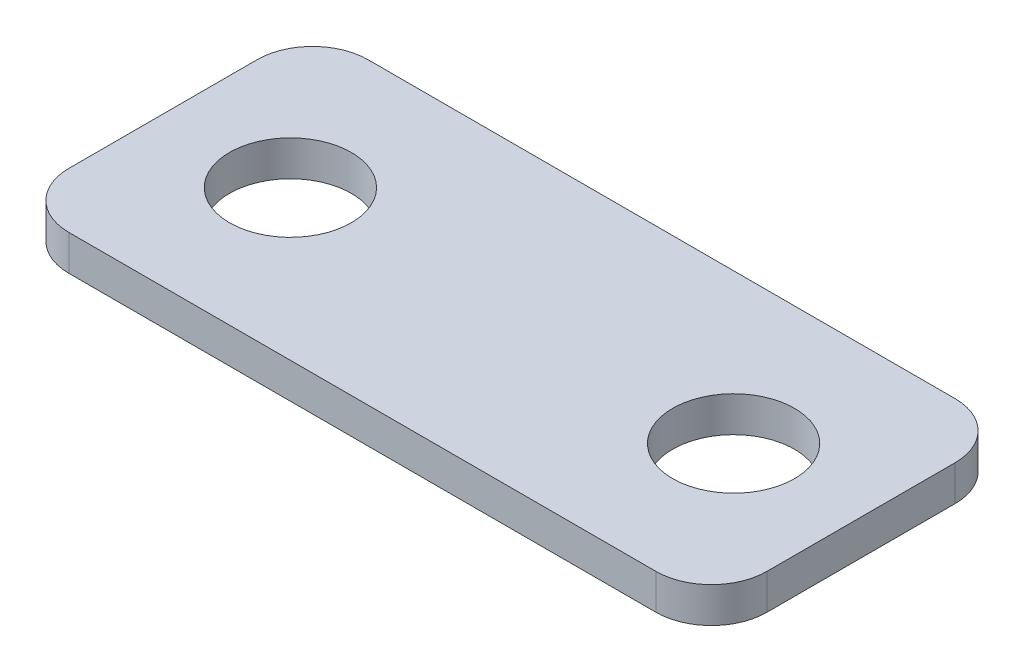
ISO-10303-21;
HEADER;
FILE_DESCRIPTION(('STEP AP214'),'2;1');
FILE_NAME('part.step','',(''),(''),'','','');
FILE_SCHEMA(('AUTOMOTIVE_DESIGN { 1 0 10303 214 1 1 1 1 }'));
ENDSEC;
DATA;
#1=APPLICATION_CONTEXT('core data for automotive mechanical design processes');
#2=APPLICATION_PROTOCOL_DEFINITION('international standard','automotive_design',2000,#1);
#3=PRODUCT_CONTEXT('',#1,'mechanical');
#4=PRODUCT('Part','Part','',(#3));
#5=PRODUCT_RELATED_PRODUCT_CATEGORY('part','',(#4));
#6=PRODUCT_DEFINITION_FORMATION('','',#4);
#7=PRODUCT_DEFINITION_CONTEXT('part definition',#1,'design');
#8=PRODUCT_DEFINITION('design','',#6,#7);
#9=PRODUCT_DEFINITION_SHAPE('','',#8);
#10=(LENGTH_UNIT() NAMED_UNIT(*) SI_UNIT(.MILLI.,.METRE.));
#11=(NAMED_UNIT(*) PLANE_ANGLE_UNIT() SI_UNIT($,.RADIAN.));
#12=(NAMED_UNIT(*) SI_UNIT($,.STERADIAN.) SOLID_ANGLE_UNIT());
#13=UNCERTAINTY_MEASURE_WITH_UNIT(LENGTH_MEASURE(1.E-05),#10,'distance_accuracy_value','');
#14=(GEOMETRIC_REPRESENTATION_CONTEXT(3) GLOBAL_UNCERTAINTY_ASSIGNED_CONTEXT((#13)) GLOBAL_UNIT_ASSIGNED_CONTEXT((#10,
#11,#12)) REPRESENTATION_CONTEXT('',''));
#15=CARTESIAN_POINT('',(0.,0.,0.));
#16=DIRECTION('',(0.,0.,1.));
#17=DIRECTION('',(1.,0.,0.));
#18=AXIS2_PLACEMENT_3D('',#15,#16,#17);
#19=CARTESIAN_POINT('',(26.5,-3.2,8.5));
#20=DIRECTION('',(0.,1.,0.));
#21=DIRECTION('',(0.,0.,1.));
#22=AXIS2_PLACEMENT_3D('',#19,#20,#21);
#23=CYLINDRICAL_SURFACE('',#22,5.);
#24=CARTESIAN_POINT('',(26.5,0.,8.5));
#25=DIRECTION('',(0.,1.,0.));
#26=DIRECTION('',(0.,0.,1.));
#27=AXIS2_PLACEMENT_3D('',#24,#25,#26);
#28=CIRCLE('',#27,5.);
#29=CARTESIAN_POINT('',(26.5,0.,13.5));
#30=VERTEX_POINT('',#29);
#31=CARTESIAN_POINT('',(31.5,0.,8.5));
#32=VERTEX_POINT('',#31);
#33=EDGE_CURVE('E138',#30,#32,#28,.T.);
#34=ORIENTED_EDGE('',*,*,#33,.F.);
#35=DIRECTION('',(0.,1.,0.));
#36=VECTOR('',#35,1.);
#37=CARTESIAN_POINT('',(26.5,-3.2,13.5));
#38=LINE('',#37,#36);
#39=CARTESIAN_POINT('',(26.5,-3.2,13.5));
#40=VERTEX_POINT('',#39);
#41=EDGE_CURVE('E11',#40,#30,#38,.T.);
#42=ORIENTED_EDGE('',*,*,#41,.F.);
#43=CARTESIAN_POINT('',(26.5,-3.2,8.5));
#44=DIRECTION('',(0.,1.,0.));
#45=DIRECTION('',(0.,0.,1.));
#46=AXIS2_PLACEMENT_3D('',#43,#44,#45);
#47=CIRCLE('',#46,5.);
#48=CARTESIAN_POINT('',(31.5,-3.2,8.5));
#49=VERTEX_POINT('',#48);
#50=EDGE_CURVE('E159',#40,#49,#47,.T.);
#51=ORIENTED_EDGE('',*,*,#50,.T.);
#52=DIRECTION('',(0.,1.,0.));
#53=VECTOR('',#52,1.);
#54=CARTESIAN_POINT('',(31.5,-3.2,8.5));
#55=LINE('',#54,#53);
#56=EDGE_CURVE('E44',#49,#32,#55,.T.);
#57=ORIENTED_EDGE('',*,*,#56,.T.);
#58=EDGE_LOOP('',(#34,#42,#51,#57));
#59=FACE_BOUND('',#58,.T.);
#60=ADVANCED_FACE('F41',(#59),#23,.T.);
#61=CARTESIAN_POINT('',(26.5,-3.2,13.5));
#62=DIRECTION('',(0.,0.,1.));
#63=DIRECTION('',(1.,0.,0.));
#64=AXIS2_PLACEMENT_3D('',#61,#62,#63);
#65=PLANE('',#64);
#66=DIRECTION('',(1.,0.,0.));
#67=VECTOR('',#66,1.);
#68=CARTESIAN_POINT('',(26.5,0.,13.5));
#69=LINE('',#68,#67);
#70=CARTESIAN_POINT('',(-26.5,0.,13.5));
#71=VERTEX_POINT('',#70);
#72=EDGE_CURVE('E157',#71,#30,#69,.T.);
#73=ORIENTED_EDGE('',*,*,#72,.F.);
#74=DIRECTION('',(0.,1.,0.));
#75=VECTOR('',#74,1.);
#76=CARTESIAN_POINT('',(-26.5,-3.2,13.5));
#77=LINE('',#76,#75);
#78=CARTESIAN_POINT('',(-26.5,-3.2,13.5));
#79=VERTEX_POINT('',#78);
#80=EDGE_CURVE('E50',#79,#71,#77,.T.);
#81=ORIENTED_EDGE('',*,*,#80,.F.);
#82=DIRECTION('',(1.,0.,0.));
#83=VECTOR('',#82,1.);
#84=CARTESIAN_POINT('',(26.5,-3.2,13.5));
#85=LINE('',#84,#83);
#86=EDGE_CURVE('E128',#79,#40,#85,.T.);
#87=ORIENTED_EDGE('',*,*,#86,.T.);
#88=ORIENTED_EDGE('',*,*,#41,.T.);
#89=EDGE_LOOP('',(#73,#81,#87,#88));
#90=FACE_BOUND('',#89,.T.);
#91=ADVANCED_FACE('F171',(#90),#65,.T.);
#92=CARTESIAN_POINT('',(-26.5,-3.2,8.5));
#93=DIRECTION('',(0.,1.,0.));
#94=DIRECTION('',(0.,0.,1.));
#95=AXIS2_PLACEMENT_3D('',#92,#93,#94);
#96=CYLINDRICAL_SURFACE('',#95,5.);
#97=CARTESIAN_POINT('',(-26.5,0.,8.5));
#98=DIRECTION('',(0.,1.,0.));
#99=DIRECTION('',(0.,0.,-1.));
#100=AXIS2_PLACEMENT_3D('',#97,#98,#99);
#101=CIRCLE('',#100,5.);
#102=CARTESIAN_POINT('',(-31.5,0.,8.5));
#103=VERTEX_POINT('',#102);
#104=EDGE_CURVE('E115',#103,#71,#101,.T.);
#105=ORIENTED_EDGE('',*,*,#104,.F.);
#106=DIRECTION('',(0.,1.,0.));
#107=VECTOR('',#106,1.);
#108=CARTESIAN_POINT('',(-31.5,-3.2,8.5));
#109=LINE('',#108,#107);
#110=CARTESIAN_POINT('',(-31.5,-3.2,8.5));
#111=VERTEX_POINT('',#110);
#112=EDGE_CURVE('E110',#111,#103,#109,.T.);
#113=ORIENTED_EDGE('',*,*,#112,.F.);
#114=CARTESIAN_POINT('',(-26.5,-3.2,8.5));
#115=DIRECTION('',(0.,1.,0.));
#116=DIRECTION('',(0.,0.,-1.));
#117=AXIS2_PLACEMENT_3D('',#114,#115,#116);
#118=CIRCLE('',#117,5.);
#119=EDGE_CURVE('E113',#111,#79,#118,.T.);
#120=ORIENTED_EDGE('',*,*,#119,.T.);
#121=ORIENTED_EDGE('',*,*,#80,.T.);
#122=EDGE_LOOP('',(#105,#113,#120,#121));
#123=FACE_BOUND('',#122,.T.);
#124=ADVANCED_FACE('F112',(#123),#96,.T.);
#125=CARTESIAN_POINT('',(-31.5,-3.2,8.5));
#126=DIRECTION('',(-1.,0.,0.));
#127=DIRECTION('',(0.,0.,1.));
#128=AXIS2_PLACEMENT_3D('',#125,#126,#127);
#129=PLANE('',#128);
#130=DIRECTION('',(0.,0.,1.));
#131=VECTOR('',#130,1.);
#132=CARTESIAN_POINT('',(-31.5,0.,8.5));
#133=LINE('',#132,#131);
#134=CARTESIAN_POINT('',(-31.5,0.,-8.5));
#135=VERTEX_POINT('',#134);
#136=EDGE_CURVE('E154',#135,#103,#133,.T.);
#137=ORIENTED_EDGE('',*,*,#136,.F.);
#138=DIRECTION('',(0.,1.,0.));
#139=VECTOR('',#138,1.);
#140=CARTESIAN_POINT('',(-31.5,-3.2,-8.5));
#141=LINE('',#140,#139);
#142=CARTESIAN_POINT('',(-31.5,-3.2,-8.5));
#143=VERTEX_POINT('',#142);
#144=EDGE_CURVE('E120',#143,#135,#141,.T.);
#145=ORIENTED_EDGE('',*,*,#144,.F.);
#146=DIRECTION('',(0.,0.,1.));
#147=VECTOR('',#146,1.);
#148=CARTESIAN_POINT('',(-31.5,-3.2,8.5));
#149=LINE('',#148,#147);
#150=EDGE_CURVE('E126',#143,#111,#149,.T.);
#151=ORIENTED_EDGE('',*,*,#150,.T.);
#152=ORIENTED_EDGE('',*,*,#112,.T.);
#153=EDGE_LOOP('',(#137,#145,#151,#152));
#154=FACE_BOUND('',#153,.T.);
#155=ADVANCED_FACE('F130',(#154),#129,.T.);
#156=CARTESIAN_POINT('',(-26.5,-3.2,-8.5));
#157=DIRECTION('',(0.,1.,0.));
#158=DIRECTION('',(0.,0.,1.));
#159=AXIS2_PLACEMENT_3D('',#156,#157,#158);
#160=CYLINDRICAL_SURFACE('',#159,5.);
#161=CARTESIAN_POINT('',(-26.5,0.,-8.5));
#162=DIRECTION('',(0.,1.,0.));
#163=DIRECTION('',(0.,0.,1.));
#164=AXIS2_PLACEMENT_3D('',#161,#162,#163);
#165=CIRCLE('',#164,5.);
#166=CARTESIAN_POINT('',(-26.5,0.,-13.5));
#167=VERTEX_POINT('',#166);
#168=EDGE_CURVE('E151',#167,#135,#165,.T.);
#169=ORIENTED_EDGE('',*,*,#168,.F.);
#170=DIRECTION('',(0.,1.,0.));
#171=VECTOR('',#170,1.);
#172=CARTESIAN_POINT('',(-26.5,-3.2,-13.5));
#173=LINE('',#172,#171);
#174=CARTESIAN_POINT('',(-26.5,-3.2,-13.5));
#175=VERTEX_POINT('',#174);
#176=EDGE_CURVE('E163',#175,#167,#173,.T.);
#177=ORIENTED_EDGE('',*,*,#176,.F.);
#178=CARTESIAN_POINT('',(-26.5,-3.2,-8.5));
#179=DIRECTION('',(0.,1.,0.));
#180=DIRECTION('',(0.,0.,1.));
#181=AXIS2_PLACEMENT_3D('',#178,#179,#180);
#182=CIRCLE('',#181,5.);
#183=EDGE_CURVE('E131',#175,#143,#182,.T.);
#184=ORIENTED_EDGE('',*,*,#183,.T.);
#185=ORIENTED_EDGE('',*,*,#144,.T.);
#186=EDGE_LOOP('',(#169,#177,#184,#185));
#187=FACE_BOUND('',#186,.T.);
#188=ADVANCED_FACE('F184',(#187),#160,.T.);
#189=CARTESIAN_POINT('',(26.5,-3.2,-13.5));
#190=DIRECTION('',(0.,0.,-1.));
#191=DIRECTION('',(-1.,0.,0.));
#192=AXIS2_PLACEMENT_3D('',#189,#190,#191);
#193=PLANE('',#192);
#194=DIRECTION('',(-1.,0.,0.));
#195=VECTOR('',#194,1.);
#196=CARTESIAN_POINT('',(26.5,0.,-13.5));
#197=LINE('',#196,#195);
#198=CARTESIAN_POINT('',(26.5,0.,-13.5));
#199=VERTEX_POINT('',#198);
#200=EDGE_CURVE('E148',#199,#167,#197,.T.);
#201=ORIENTED_EDGE('',*,*,#200,.F.);
#202=DIRECTION('',(0.,1.,0.));
#203=VECTOR('',#202,1.);
#204=CARTESIAN_POINT('',(26.5,-3.2,-13.5));
#205=LINE('',#204,#203);
#206=CARTESIAN_POINT('',(26.5,-3.2,-13.5));
#207=VERTEX_POINT('',#206);
#208=EDGE_CURVE('E165',#207,#199,#205,.T.);
#209=ORIENTED_EDGE('',*,*,#208,.F.);
#210=DIRECTION('',(-1.,0.,0.));
#211=VECTOR('',#210,1.);
#212=CARTESIAN_POINT('',(26.5,-3.2,-13.5));
#213=LINE('',#212,#211);
#214=EDGE_CURVE('E133',#207,#175,#213,.T.);
#215=ORIENTED_EDGE('',*,*,#214,.T.);
#216=ORIENTED_EDGE('',*,*,#176,.T.);
#217=EDGE_LOOP('',(#201,#209,#215,#216));
#218=FACE_BOUND('',#217,.T.);
#219=ADVANCED_FACE('F187',(#218),#193,.T.);
#220=CARTESIAN_POINT('',(26.5,-3.2,-8.5));
#221=DIRECTION('',(0.,1.,0.));
#222=DIRECTION('',(0.,0.,1.));
#223=AXIS2_PLACEMENT_3D('',#220,#221,#222);
#224=CYLINDRICAL_SURFACE('',#223,5.);
#225=CARTESIAN_POINT('',(26.5,0.,-8.5));
#226=DIRECTION('',(0.,1.,0.));
#227=DIRECTION('',(0.,0.,1.));
#228=AXIS2_PLACEMENT_3D('',#225,#226,#227);
#229=CIRCLE('',#228,5.);
#230=CARTESIAN_POINT('',(31.5,0.,-8.5));
#231=VERTEX_POINT('',#230);
#232=EDGE_CURVE('E145',#231,#199,#229,.T.);
#233=ORIENTED_EDGE('',*,*,#232,.F.);
#234=DIRECTION('',(0.,1.,0.));
#235=VECTOR('',#234,1.);
#236=CARTESIAN_POINT('',(31.5,-3.2,-8.5));
#237=LINE('',#236,#235);
#238=CARTESIAN_POINT('',(31.5,-3.2,-8.5));
#239=VERTEX_POINT('',#238);
#240=EDGE_CURVE('E166',#239,#231,#237,.T.);
#241=ORIENTED_EDGE('',*,*,#240,.F.);
#242=CARTESIAN_POINT('',(26.5,-3.2,-8.5));
#243=DIRECTION('',(0.,1.,0.));
#244=DIRECTION('',(0.,0.,1.));
#245=AXIS2_PLACEMENT_3D('',#242,#243,#244);
#246=CIRCLE('',#245,5.);
#247=EDGE_CURVE('E233',#239,#207,#246,.T.);
#248=ORIENTED_EDGE('',*,*,#247,.T.);
#249=ORIENTED_EDGE('',*,*,#208,.T.);
#250=EDGE_LOOP('',(#233,#241,#248,#249));
#251=FACE_BOUND('',#250,.T.);
#252=ADVANCED_FACE('F191',(#251),#224,.T.);
#253=CARTESIAN_POINT('',(31.5,-3.2,8.5));
#254=DIRECTION('',(1.,0.,0.));
#255=DIRECTION('',(0.,0.,-1.));
#256=AXIS2_PLACEMENT_3D('',#253,#254,#255);
#257=PLANE('',#256);
#258=DIRECTION('',(0.,0.,-1.));
#259=VECTOR('',#258,1.);
#260=CARTESIAN_POINT('',(31.5,0.,8.5));
#261=LINE('',#260,#259);
#262=EDGE_CURVE('E141',#32,#231,#261,.T.);
#263=ORIENTED_EDGE('',*,*,#262,.F.);
#264=ORIENTED_EDGE('',*,*,#56,.F.);
#265=DIRECTION('',(0.,0.,-1.));
#266=VECTOR('',#265,1.);
#267=CARTESIAN_POINT('',(31.5,-3.2,8.5));
#268=LINE('',#267,#266);
#269=EDGE_CURVE('E231',#49,#239,#268,.T.);
#270=ORIENTED_EDGE('',*,*,#269,.T.);
#271=ORIENTED_EDGE('',*,*,#240,.T.);
#272=EDGE_LOOP('',(#263,#264,#270,#271));
#273=FACE_BOUND('',#272,.T.);
#274=ADVANCED_FACE('F168',(#273),#257,.T.);
#275=CARTESIAN_POINT('',(26.5,-3.2,8.5));
#276=DIRECTION('',(0.,1.,0.));
#277=DIRECTION('',(0.,0.,1.));
#278=AXIS2_PLACEMENT_3D('',#275,#276,#277);
#279=PLANE('',#278);
#280=CARTESIAN_POINT('',(20.,-3.2,0.));
#281=DIRECTION('',(0.,1.,0.));
#282=DIRECTION('',(0.,0.,1.));
#283=AXIS2_PLACEMENT_3D('',#280,#281,#282);
#284=CIRCLE('',#283,5.5);
#285=CARTESIAN_POINT('',(20.,-3.2,5.49999999999999));
#286=VERTEX_POINT('',#285);
#287=EDGE_CURVE('E218',#286,#286,#284,.T.);
#288=ORIENTED_EDGE('',*,*,#287,.T.);
#289=EDGE_LOOP('',(#288));
#290=FACE_BOUND('',#289,.T.);
#291=CARTESIAN_POINT('',(-20.,-3.2,0.));
#292=DIRECTION('',(0.,1.,0.));
#293=DIRECTION('',(0.,0.,1.));
#294=AXIS2_PLACEMENT_3D('',#291,#292,#293);
#295=CIRCLE('',#294,5.5);
#296=CARTESIAN_POINT('',(-20.,-3.2,5.5));
#297=VERTEX_POINT('',#296);
#298=EDGE_CURVE('E142',#297,#297,#295,.T.);
#299=ORIENTED_EDGE('',*,*,#298,.T.);
#300=EDGE_LOOP('',(#299));
#301=FACE_BOUND('',#300,.T.);
#302=ORIENTED_EDGE('',*,*,#50,.F.);
#303=ORIENTED_EDGE('',*,*,#86,.F.);
#304=ORIENTED_EDGE('',*,*,#119,.F.);
#305=ORIENTED_EDGE('',*,*,#150,.F.);
#306=ORIENTED_EDGE('',*,*,#183,.F.);
#307=ORIENTED_EDGE('',*,*,#214,.F.);
#308=ORIENTED_EDGE('',*,*,#247,.F.);
#309=ORIENTED_EDGE('',*,*,#269,.F.);
#310=EDGE_LOOP('',(#302,#303,#304,#305,#306,#307,#308,#309));
#311=FACE_BOUND('',#310,.T.);
#312=ADVANCED_FACE('F124',(#290,#301,#311),#279,.F.);
#313=CARTESIAN_POINT('',(26.5,0.,8.5));
#314=DIRECTION('',(0.,1.,0.));
#315=DIRECTION('',(0.,0.,1.));
#316=AXIS2_PLACEMENT_3D('',#313,#314,#315);
#317=PLANE('',#316);
#318=CARTESIAN_POINT('',(20.,0.,0.));
#319=DIRECTION('',(0.,1.,0.));
#320=DIRECTION('',(0.,0.,1.));
#321=AXIS2_PLACEMENT_3D('',#318,#319,#320);
#322=CIRCLE('',#321,5.5);
#323=CARTESIAN_POINT('',(20.,0.,5.49999999999999));
#324=VERTEX_POINT('',#323);
#325=EDGE_CURVE('E221',#324,#324,#322,.T.);
#326=ORIENTED_EDGE('',*,*,#325,.F.);
#327=EDGE_LOOP('',(#326));
#328=FACE_BOUND('',#327,.T.);
#329=CARTESIAN_POINT('',(-20.,0.,0.));
#330=DIRECTION('',(0.,1.,0.));
#331=DIRECTION('',(0.,0.,1.));
#332=AXIS2_PLACEMENT_3D('',#329,#330,#331);
#333=CIRCLE('',#332,5.5);
#334=CARTESIAN_POINT('',(-20.,0.,5.5));
#335=VERTEX_POINT('',#334);
#336=EDGE_CURVE('E223',#335,#335,#333,.T.);
#337=ORIENTED_EDGE('',*,*,#336,.F.);
#338=EDGE_LOOP('',(#337));
#339=FACE_BOUND('',#338,.T.);
#340=ORIENTED_EDGE('',*,*,#33,.T.);
#341=ORIENTED_EDGE('',*,*,#262,.T.);
#342=ORIENTED_EDGE('',*,*,#232,.T.);
#343=ORIENTED_EDGE('',*,*,#200,.T.);
#344=ORIENTED_EDGE('',*,*,#168,.T.);
#345=ORIENTED_EDGE('',*,*,#136,.T.);
#346=ORIENTED_EDGE('',*,*,#104,.T.);
#347=ORIENTED_EDGE('',*,*,#72,.T.);
#348=EDGE_LOOP('',(#340,#341,#342,#343,#344,#345,#346,#347));
#349=FACE_BOUND('',#348,.T.);
#350=ADVANCED_FACE('F170',(#328,#339,#349),#317,.T.);
#351=CARTESIAN_POINT('',(-20.,-3.2,0.));
#352=DIRECTION('',(0.,1.,0.));
#353=DIRECTION('',(0.,0.,1.));
#354=AXIS2_PLACEMENT_3D('',#351,#352,#353);
#355=CYLINDRICAL_SURFACE('',#354,5.5);
#356=ORIENTED_EDGE('',*,*,#298,.F.);
#357=EDGE_LOOP('',(#356));
#358=FACE_BOUND('',#357,.T.);
#359=ORIENTED_EDGE('',*,*,#336,.T.);
#360=EDGE_LOOP('',(#359));
#361=FACE_BOUND('',#360,.T.);
#362=ADVANCED_FACE('F203',(#358,#361),#355,.F.);
#363=CARTESIAN_POINT('',(20.,-3.2,0.));
#364=DIRECTION('',(0.,1.,0.));
#365=DIRECTION('',(0.,0.,1.));
#366=AXIS2_PLACEMENT_3D('',#363,#364,#365);
#367=CYLINDRICAL_SURFACE('',#366,5.5);
#368=ORIENTED_EDGE('',*,*,#287,.F.);
#369=EDGE_LOOP('',(#368));
#370=FACE_BOUND('',#369,.T.);
#371=ORIENTED_EDGE('',*,*,#325,.T.);
#372=EDGE_LOOP('',(#371));
#373=FACE_BOUND('',#372,.T.);
#374=ADVANCED_FACE('F210',(#370,#373),#367,.F.);
#375=CLOSED_SHELL('',(#60,#91,#124,#155,#188,#219,#252,#274,#312,#350,#362,#374));
#376=MANIFOLD_SOLID_BREP('B2',#375);
#377=ADVANCED_BREP_SHAPE_REPRESENTATION('',(#18,#376),#14);
#378=SHAPE_DEFINITION_REPRESENTATION(#9,#377);
ENDSEC;
END-ISO-10303-21;
